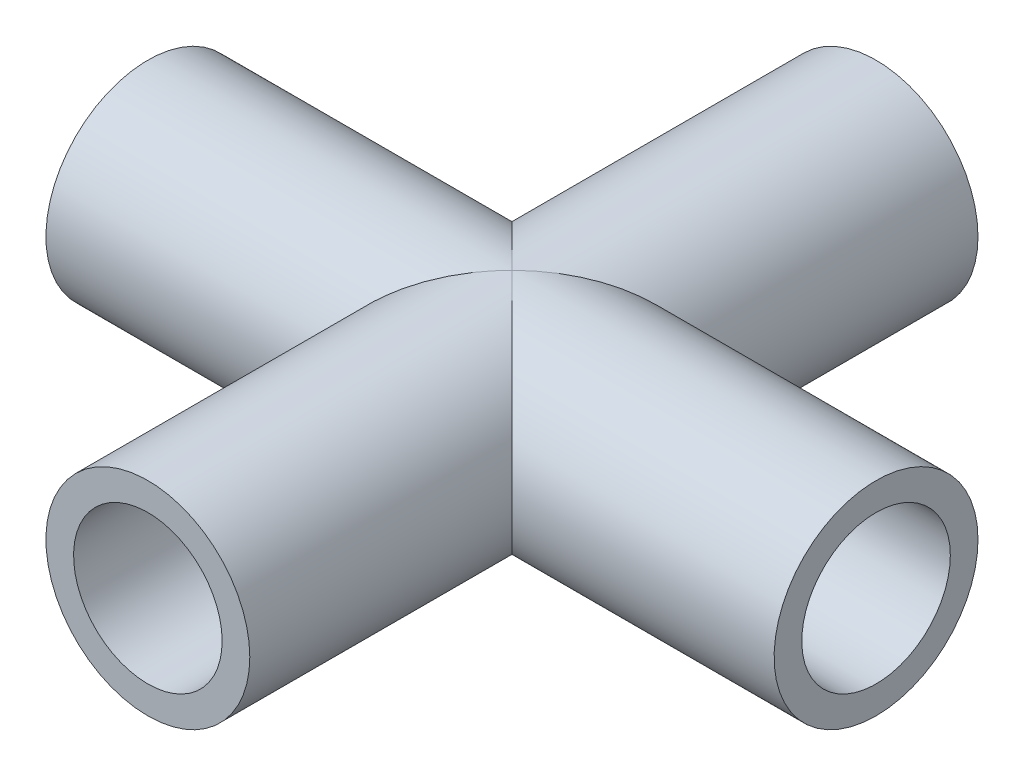
ISO-10303-21;
HEADER;
FILE_DESCRIPTION(('STEP AP214'),'2;1');
FILE_NAME('part.step','',(''),(''),'','','');
FILE_SCHEMA(('AUTOMOTIVE_DESIGN { 1 0 10303 214 1 1 1 1 }'));
ENDSEC;
DATA;
#1=APPLICATION_CONTEXT('core data for automotive mechanical design processes');
#2=APPLICATION_PROTOCOL_DEFINITION('international standard','automotive_design',2000,#1);
#3=PRODUCT_CONTEXT('',#1,'mechanical');
#4=PRODUCT('Part','Part','',(#3));
#5=PRODUCT_RELATED_PRODUCT_CATEGORY('part','',(#4));
#6=PRODUCT_DEFINITION_FORMATION('','',#4);
#7=PRODUCT_DEFINITION_CONTEXT('part definition',#1,'design');
#8=PRODUCT_DEFINITION('design','',#6,#7);
#9=PRODUCT_DEFINITION_SHAPE('','',#8);
#10=(LENGTH_UNIT() NAMED_UNIT(*) SI_UNIT(.MILLI.,.METRE.));
#11=(NAMED_UNIT(*) PLANE_ANGLE_UNIT() SI_UNIT($,.RADIAN.));
#12=(NAMED_UNIT(*) SI_UNIT($,.STERADIAN.) SOLID_ANGLE_UNIT());
#13=UNCERTAINTY_MEASURE_WITH_UNIT(LENGTH_MEASURE(1.E-05),#10,'distance_accuracy_value','');
#14=(GEOMETRIC_REPRESENTATION_CONTEXT(3) GLOBAL_UNCERTAINTY_ASSIGNED_CONTEXT((#13)) GLOBAL_UNIT_ASSIGNED_CONTEXT((#10,
#11,#12)) REPRESENTATION_CONTEXT('',''));
#15=CARTESIAN_POINT('',(0.,0.,0.));
#16=DIRECTION('',(0.,0.,1.));
#17=DIRECTION('',(1.,0.,0.));
#18=AXIS2_PLACEMENT_3D('',#15,#16,#17);
#19=CARTESIAN_POINT('',(0.,0.,63.5));
#20=DIRECTION('',(0.,0.,-1.));
#21=DIRECTION('',(-1.,0.,0.));
#22=AXIS2_PLACEMENT_3D('',#19,#20,#21);
#23=CYLINDRICAL_SURFACE('',#22,6.477);
#24=CARTESIAN_POINT('',(0.,0.,31.75));
#25=DIRECTION('',(0.707106781186547,0.,-0.707106781186547));
#26=DIRECTION('',(-0.707106781186547,0.,-0.707106781186547));
#27=AXIS2_PLACEMENT_3D('',#24,#25,#26);
#28=ELLIPSE('',#27,9.15986124349053,6.477);
#29=CARTESIAN_POINT('',(0.,-6.477,31.75));
#30=VERTEX_POINT('',#29);
#31=CARTESIAN_POINT('',(0.,6.477,31.75));
#32=VERTEX_POINT('',#31);
#33=EDGE_CURVE('E11',#30,#32,#28,.F.);
#34=ORIENTED_EDGE('',*,*,#33,.F.);
#35=CARTESIAN_POINT('',(0.,0.,31.75));
#36=DIRECTION('',(-0.707106781186547,0.,-0.707106781186547));
#37=DIRECTION('',(0.707106781186547,0.,-0.707106781186547));
#38=AXIS2_PLACEMENT_3D('',#35,#36,#37);
#39=ELLIPSE('',#38,9.15986124349053,6.477);
#40=EDGE_CURVE('E46',#32,#30,#39,.F.);
#41=ORIENTED_EDGE('',*,*,#40,.F.);
#42=EDGE_LOOP('',(#34,#41));
#43=FACE_BOUND('',#42,.T.);
#44=CARTESIAN_POINT('',(0.,0.,63.5));
#45=DIRECTION('',(0.,0.,1.));
#46=DIRECTION('',(1.,0.,0.));
#47=AXIS2_PLACEMENT_3D('',#44,#45,#46);
#48=CIRCLE('',#47,6.477);
#49=CARTESIAN_POINT('',(6.477,0.,63.5));
#50=VERTEX_POINT('',#49);
#51=EDGE_CURVE('E78',#50,#50,#48,.T.);
#52=ORIENTED_EDGE('',*,*,#51,.T.);
#53=EDGE_LOOP('',(#52));
#54=FACE_BOUND('',#53,.T.);
#55=ADVANCED_FACE('F32',(#43,#54),#23,.F.);
#56=CARTESIAN_POINT('',(0.,0.,63.5));
#57=DIRECTION('',(0.,0.,-1.));
#58=DIRECTION('',(-1.,0.,0.));
#59=AXIS2_PLACEMENT_3D('',#56,#57,#58);
#60=CYLINDRICAL_SURFACE('',#59,8.89);
#61=CARTESIAN_POINT('',(0.,0.,63.5));
#62=DIRECTION('',(0.,0.,1.));
#63=DIRECTION('',(1.,0.,0.));
#64=AXIS2_PLACEMENT_3D('',#61,#62,#63);
#65=CIRCLE('',#64,8.89);
#66=CARTESIAN_POINT('',(8.89,0.,63.5));
#67=VERTEX_POINT('',#66);
#68=EDGE_CURVE('E69',#67,#67,#65,.T.);
#69=ORIENTED_EDGE('',*,*,#68,.F.);
#70=EDGE_LOOP('',(#69));
#71=FACE_BOUND('',#70,.T.);
#72=CARTESIAN_POINT('',(0.,0.,31.75));
#73=DIRECTION('',(-0.707106781186547,0.,-0.707106781186547));
#74=DIRECTION('',(0.707106781186547,0.,-0.707106781186547));
#75=AXIS2_PLACEMENT_3D('',#72,#73,#74);
#76=ELLIPSE('',#75,12.5723585694968,8.89);
#77=CARTESIAN_POINT('',(0.,-8.88999999999999,31.75));
#78=VERTEX_POINT('',#77);
#79=CARTESIAN_POINT('',(0.,8.89,31.75));
#80=VERTEX_POINT('',#79);
#81=EDGE_CURVE('E89',#78,#80,#76,.T.);
#82=ORIENTED_EDGE('',*,*,#81,.F.);
#83=CARTESIAN_POINT('',(0.,0.,31.75));
#84=DIRECTION('',(0.707106781186547,0.,-0.707106781186547));
#85=DIRECTION('',(-0.707106781186547,0.,-0.707106781186547));
#86=AXIS2_PLACEMENT_3D('',#83,#84,#85);
#87=ELLIPSE('',#86,12.5723585694968,8.89);
#88=EDGE_CURVE('E91',#80,#78,#87,.T.);
#89=ORIENTED_EDGE('',*,*,#88,.F.);
#90=EDGE_LOOP('',(#82,#89));
#91=FACE_BOUND('',#90,.T.);
#92=ADVANCED_FACE('F125',(#71,#91),#60,.T.);
#93=CARTESIAN_POINT('',(0.,0.,63.5));
#94=DIRECTION('',(0.,0.,1.));
#95=DIRECTION('',(1.,0.,0.));
#96=AXIS2_PLACEMENT_3D('',#93,#94,#95);
#97=PLANE('',#96);
#98=ORIENTED_EDGE('',*,*,#68,.T.);
#99=EDGE_LOOP('',(#98));
#100=FACE_BOUND('',#99,.T.);
#101=ORIENTED_EDGE('',*,*,#51,.F.);
#102=EDGE_LOOP('',(#101));
#103=FACE_BOUND('',#102,.T.);
#104=ADVANCED_FACE('F120',(#100,#103),#97,.T.);
#105=CARTESIAN_POINT('',(31.75,0.,31.75));
#106=DIRECTION('',(-1.,0.,0.));
#107=DIRECTION('',(0.,0.,1.));
#108=AXIS2_PLACEMENT_3D('',#105,#106,#107);
#109=CYLINDRICAL_SURFACE('',#108,8.88999999999999);
#110=CARTESIAN_POINT('',(31.75,0.,31.75));
#111=DIRECTION('',(1.,0.,0.));
#112=DIRECTION('',(0.,0.,-1.));
#113=AXIS2_PLACEMENT_3D('',#110,#111,#112);
#114=CIRCLE('',#113,8.88999999999999);
#115=CARTESIAN_POINT('',(31.75,0.,22.86));
#116=VERTEX_POINT('',#115);
#117=EDGE_CURVE('E95',#116,#116,#114,.T.);
#118=ORIENTED_EDGE('',*,*,#117,.F.);
#119=EDGE_LOOP('',(#118));
#120=FACE_BOUND('',#119,.T.);
#121=ORIENTED_EDGE('',*,*,#88,.T.);
#122=CARTESIAN_POINT('',(0.,0.,31.75));
#123=DIRECTION('',(-0.707106781186547,0.,-0.707106781186547));
#124=DIRECTION('',(0.707106781186547,0.,-0.707106781186547));
#125=AXIS2_PLACEMENT_3D('',#122,#123,#124);
#126=ELLIPSE('',#125,12.5723585694968,8.89);
#127=EDGE_CURVE('E84',#78,#80,#126,.F.);
#128=ORIENTED_EDGE('',*,*,#127,.T.);
#129=EDGE_LOOP('',(#121,#128));
#130=FACE_BOUND('',#129,.T.);
#131=ADVANCED_FACE('F111',(#120,#130),#109,.T.);
#132=CARTESIAN_POINT('',(31.75,0.,31.75));
#133=DIRECTION('',(1.,0.,0.));
#134=DIRECTION('',(0.,0.,-1.));
#135=AXIS2_PLACEMENT_3D('',#132,#133,#134);
#136=PLANE('',#135);
#137=ORIENTED_EDGE('',*,*,#117,.T.);
#138=EDGE_LOOP('',(#137));
#139=FACE_BOUND('',#138,.T.);
#140=CARTESIAN_POINT('',(31.75,0.,31.75));
#141=DIRECTION('',(1.,0.,0.));
#142=DIRECTION('',(0.,0.,-1.));
#143=AXIS2_PLACEMENT_3D('',#140,#141,#142);
#144=CIRCLE('',#143,6.477);
#145=CARTESIAN_POINT('',(31.75,0.,25.273));
#146=VERTEX_POINT('',#145);
#147=EDGE_CURVE('E99',#146,#146,#144,.T.);
#148=ORIENTED_EDGE('',*,*,#147,.F.);
#149=EDGE_LOOP('',(#148));
#150=FACE_BOUND('',#149,.T.);
#151=ADVANCED_FACE('F109',(#139,#150),#136,.T.);
#152=CARTESIAN_POINT('',(31.75,0.,31.75));
#153=DIRECTION('',(-1.,0.,0.));
#154=DIRECTION('',(0.,0.,1.));
#155=AXIS2_PLACEMENT_3D('',#152,#153,#154);
#156=CYLINDRICAL_SURFACE('',#155,6.477);
#157=ORIENTED_EDGE('',*,*,#147,.T.);
#158=EDGE_LOOP('',(#157));
#159=FACE_BOUND('',#158,.T.);
#160=ORIENTED_EDGE('',*,*,#33,.T.);
#161=CARTESIAN_POINT('',(0.,0.,31.75));
#162=DIRECTION('',(-0.707106781186547,0.,-0.707106781186547));
#163=DIRECTION('',(0.707106781186547,0.,-0.707106781186547));
#164=AXIS2_PLACEMENT_3D('',#161,#162,#163);
#165=ELLIPSE('',#164,9.15986124349053,6.477);
#166=EDGE_CURVE('E62',#32,#30,#165,.T.);
#167=ORIENTED_EDGE('',*,*,#166,.T.);
#168=EDGE_LOOP('',(#160,#167));
#169=FACE_BOUND('',#168,.T.);
#170=ADVANCED_FACE('F63',(#159,#169),#156,.F.);
#171=CARTESIAN_POINT('',(-31.75,0.,31.75));
#172=DIRECTION('',(1.,0.,0.));
#173=DIRECTION('',(0.,0.,-1.));
#174=AXIS2_PLACEMENT_3D('',#171,#172,#173);
#175=CIRCLE('',#174,8.88999999999999);
#176=CARTESIAN_POINT('',(-31.75,0.,22.86));
#177=VERTEX_POINT('',#176);
#178=EDGE_CURVE('E96',#177,#177,#175,.T.);
#179=ORIENTED_EDGE('',*,*,#178,.T.);
#180=EDGE_LOOP('',(#179));
#181=FACE_BOUND('',#180,.T.);
#182=CARTESIAN_POINT('',(0.,0.,31.75));
#183=DIRECTION('',(0.707106781186547,0.,-0.707106781186547));
#184=DIRECTION('',(-0.707106781186547,0.,-0.707106781186547));
#185=AXIS2_PLACEMENT_3D('',#182,#183,#184);
#186=ELLIPSE('',#185,12.5723585694968,8.89);
#187=EDGE_CURVE('E53',#80,#78,#186,.F.);
#188=ORIENTED_EDGE('',*,*,#187,.T.);
#189=ORIENTED_EDGE('',*,*,#81,.T.);
#190=EDGE_LOOP('',(#188,#189));
#191=FACE_BOUND('',#190,.T.);
#192=ADVANCED_FACE('F118',(#181,#191),#109,.T.);
#193=CARTESIAN_POINT('',(-31.75,0.,31.75));
#194=DIRECTION('',(1.,0.,0.));
#195=DIRECTION('',(0.,0.,-1.));
#196=AXIS2_PLACEMENT_3D('',#193,#194,#195);
#197=CIRCLE('',#196,6.477);
#198=CARTESIAN_POINT('',(-31.75,0.,25.273));
#199=VERTEX_POINT('',#198);
#200=EDGE_CURVE('E102',#199,#199,#197,.T.);
#201=ORIENTED_EDGE('',*,*,#200,.F.);
#202=EDGE_LOOP('',(#201));
#203=FACE_BOUND('',#202,.T.);
#204=CARTESIAN_POINT('',(0.,0.,31.75));
#205=DIRECTION('',(0.707106781186547,0.,-0.707106781186547));
#206=DIRECTION('',(-0.707106781186547,0.,-0.707106781186547));
#207=AXIS2_PLACEMENT_3D('',#204,#205,#206);
#208=ELLIPSE('',#207,9.15986124349053,6.477);
#209=EDGE_CURVE('E40',#30,#32,#208,.T.);
#210=ORIENTED_EDGE('',*,*,#209,.T.);
#211=ORIENTED_EDGE('',*,*,#40,.T.);
#212=EDGE_LOOP('',(#210,#211));
#213=FACE_BOUND('',#212,.T.);
#214=ADVANCED_FACE('F68',(#203,#213),#156,.F.);
#215=CARTESIAN_POINT('',(-31.75,0.,31.75));
#216=DIRECTION('',(1.,0.,0.));
#217=DIRECTION('',(0.,0.,-1.));
#218=AXIS2_PLACEMENT_3D('',#215,#216,#217);
#219=PLANE('',#218);
#220=ORIENTED_EDGE('',*,*,#178,.F.);
#221=EDGE_LOOP('',(#220));
#222=FACE_BOUND('',#221,.T.);
#223=ORIENTED_EDGE('',*,*,#200,.T.);
#224=EDGE_LOOP('',(#223));
#225=FACE_BOUND('',#224,.T.);
#226=ADVANCED_FACE('F141',(#222,#225),#219,.F.);
#227=CARTESIAN_POINT('',(0.,0.,0.));
#228=DIRECTION('',(0.,0.,1.));
#229=DIRECTION('',(1.,0.,0.));
#230=AXIS2_PLACEMENT_3D('',#227,#228,#229);
#231=CIRCLE('',#230,8.89);
#232=CARTESIAN_POINT('',(8.89,0.,0.));
#233=VERTEX_POINT('',#232);
#234=EDGE_CURVE('E75',#233,#233,#231,.T.);
#235=ORIENTED_EDGE('',*,*,#234,.T.);
#236=EDGE_LOOP('',(#235));
#237=FACE_BOUND('',#236,.T.);
#238=ORIENTED_EDGE('',*,*,#127,.F.);
#239=ORIENTED_EDGE('',*,*,#187,.F.);
#240=EDGE_LOOP('',(#238,#239));
#241=FACE_BOUND('',#240,.T.);
#242=ADVANCED_FACE('F34',(#237,#241),#60,.T.);
#243=CARTESIAN_POINT('',(0.,0.,0.));
#244=DIRECTION('',(0.,0.,1.));
#245=DIRECTION('',(1.,0.,0.));
#246=AXIS2_PLACEMENT_3D('',#243,#244,#245);
#247=PLANE('',#246);
#248=ORIENTED_EDGE('',*,*,#234,.F.);
#249=EDGE_LOOP('',(#248));
#250=FACE_BOUND('',#249,.T.);
#251=CARTESIAN_POINT('',(0.,0.,0.));
#252=DIRECTION('',(0.,0.,1.));
#253=DIRECTION('',(1.,0.,0.));
#254=AXIS2_PLACEMENT_3D('',#251,#252,#253);
#255=CIRCLE('',#254,6.477);
#256=CARTESIAN_POINT('',(6.477,0.,0.));
#257=VERTEX_POINT('',#256);
#258=EDGE_CURVE('E81',#257,#257,#255,.T.);
#259=ORIENTED_EDGE('',*,*,#258,.T.);
#260=EDGE_LOOP('',(#259));
#261=FACE_BOUND('',#260,.T.);
#262=ADVANCED_FACE('F133',(#250,#261),#247,.F.);
#263=ORIENTED_EDGE('',*,*,#209,.F.);
#264=ORIENTED_EDGE('',*,*,#166,.F.);
#265=EDGE_LOOP('',(#263,#264));
#266=FACE_BOUND('',#265,.T.);
#267=ORIENTED_EDGE('',*,*,#258,.F.);
#268=EDGE_LOOP('',(#267));
#269=FACE_BOUND('',#268,.T.);
#270=ADVANCED_FACE('F72',(#266,#269),#23,.F.);
#271=CLOSED_SHELL('',(#55,#92,#104,#131,#151,#170,#192,#214,#226,#242,#262,#270));
#272=MANIFOLD_SOLID_BREP('B2',#271);
#273=ADVANCED_BREP_SHAPE_REPRESENTATION('',(#18,#272),#14);
#274=SHAPE_DEFINITION_REPRESENTATION(#9,#273);
ENDSEC;
END-ISO-10303-21;
